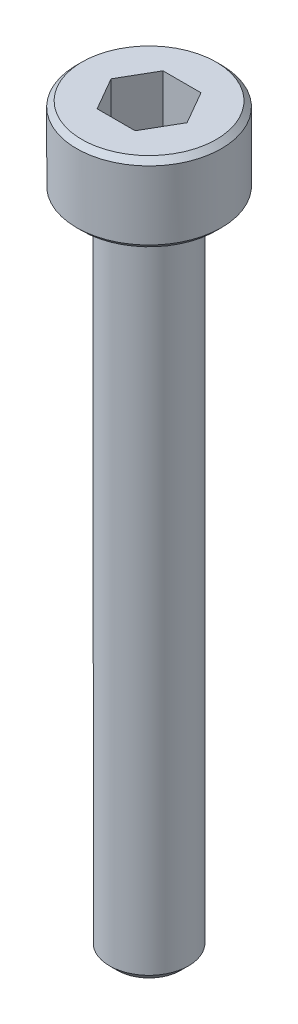
ISO-10303-21;
HEADER;
FILE_DESCRIPTION(('STEP AP214'),'2;1');
FILE_NAME('part.step','',(''),(''),'','','');
FILE_SCHEMA(('AUTOMOTIVE_DESIGN { 1 0 10303 214 1 1 1 1 }'));
ENDSEC;
DATA;
#1=APPLICATION_CONTEXT('core data for automotive mechanical design processes');
#2=APPLICATION_PROTOCOL_DEFINITION('international standard','automotive_design',2000,#1);
#3=PRODUCT_CONTEXT('',#1,'mechanical');
#4=PRODUCT('Part','Part','',(#3));
#5=PRODUCT_RELATED_PRODUCT_CATEGORY('part','',(#4));
#6=PRODUCT_DEFINITION_FORMATION('','',#4);
#7=PRODUCT_DEFINITION_CONTEXT('part definition',#1,'design');
#8=PRODUCT_DEFINITION('design','',#6,#7);
#9=PRODUCT_DEFINITION_SHAPE('','',#8);
#10=(LENGTH_UNIT() NAMED_UNIT(*) SI_UNIT(.MILLI.,.METRE.));
#11=(NAMED_UNIT(*) PLANE_ANGLE_UNIT() SI_UNIT($,.RADIAN.));
#12=(NAMED_UNIT(*) SI_UNIT($,.STERADIAN.) SOLID_ANGLE_UNIT());
#13=UNCERTAINTY_MEASURE_WITH_UNIT(LENGTH_MEASURE(1.E-05),#10,'distance_accuracy_value','');
#14=(GEOMETRIC_REPRESENTATION_CONTEXT(3) GLOBAL_UNCERTAINTY_ASSIGNED_CONTEXT((#13)) GLOBAL_UNIT_ASSIGNED_CONTEXT((#10,
#11,#12)) REPRESENTATION_CONTEXT('',''));
#15=CARTESIAN_POINT('',(0.,0.,0.));
#16=DIRECTION('',(0.,0.,1.));
#17=DIRECTION('',(1.,0.,0.));
#18=AXIS2_PLACEMENT_3D('',#15,#16,#17);
#19=CARTESIAN_POINT('',(0.721687836487033,26.,1.25));
#20=DIRECTION('',(0.866025403784439,0.,0.5));
#21=DIRECTION('',(0.5,0.,-0.866025403784439));
#22=AXIS2_PLACEMENT_3D('',#19,#20,#21);
#23=PLANE('',#22);
#24=DIRECTION('',(0.5,0.,-0.866025403784439));
#25=VECTOR('',#24,1.);
#26=CARTESIAN_POINT('',(0.721687836487033,26.,1.25));
#27=LINE('',#26,#25);
#28=CARTESIAN_POINT('',(0.721687836487033,26.,1.25));
#29=VERTEX_POINT('',#28);
#30=CARTESIAN_POINT('',(1.44337567297406,26.,0.));
#31=VERTEX_POINT('',#30);
#32=EDGE_CURVE('E66',#29,#31,#27,.T.);
#33=ORIENTED_EDGE('',*,*,#32,.F.);
#34=DIRECTION('',(0.,1.,0.));
#35=VECTOR('',#34,1.);
#36=CARTESIAN_POINT('',(0.721687836487033,26.,1.25));
#37=LINE('',#36,#35);
#38=CARTESIAN_POINT('',(0.721687836487033,28.,1.25));
#39=VERTEX_POINT('',#38);
#40=EDGE_CURVE('E85',#29,#39,#37,.T.);
#41=ORIENTED_EDGE('',*,*,#40,.T.);
#42=DIRECTION('',(0.5,0.,-0.866025403784439));
#43=VECTOR('',#42,1.);
#44=CARTESIAN_POINT('',(0.721687836487033,28.,1.25));
#45=LINE('',#44,#43);
#46=CARTESIAN_POINT('',(1.44337567297406,28.,0.));
#47=VERTEX_POINT('',#46);
#48=EDGE_CURVE('E73',#47,#39,#45,.F.);
#49=ORIENTED_EDGE('',*,*,#48,.F.);
#50=DIRECTION('',(0.,1.,0.));
#51=VECTOR('',#50,1.);
#52=CARTESIAN_POINT('',(1.44337567297406,26.,0.));
#53=LINE('',#52,#51);
#54=EDGE_CURVE('E80',#47,#31,#53,.F.);
#55=ORIENTED_EDGE('',*,*,#54,.T.);
#56=EDGE_LOOP('',(#33,#41,#49,#55));
#57=FACE_BOUND('',#56,.T.);
#58=ADVANCED_FACE('F17',(#57),#23,.F.);
#59=CARTESIAN_POINT('',(1.44337567297406,26.,0.));
#60=DIRECTION('',(0.866025403784438,0.,-0.5));
#61=DIRECTION('',(-0.5,0.,-0.866025403784438));
#62=AXIS2_PLACEMENT_3D('',#59,#60,#61);
#63=PLANE('',#62);
#64=DIRECTION('',(-0.5,0.,-0.866025403784438));
#65=VECTOR('',#64,1.);
#66=CARTESIAN_POINT('',(1.44337567297406,26.,0.));
#67=LINE('',#66,#65);
#68=CARTESIAN_POINT('',(0.721687836487031,26.,-1.25));
#69=VERTEX_POINT('',#68);
#70=EDGE_CURVE('E89',#31,#69,#67,.T.);
#71=ORIENTED_EDGE('',*,*,#70,.F.);
#72=ORIENTED_EDGE('',*,*,#54,.F.);
#73=DIRECTION('',(-0.5,0.,-0.866025403784438));
#74=VECTOR('',#73,1.);
#75=CARTESIAN_POINT('',(1.44337567297406,28.,0.));
#76=LINE('',#75,#74);
#77=CARTESIAN_POINT('',(0.721687836487032,28.,-1.25));
#78=VERTEX_POINT('',#77);
#79=EDGE_CURVE('E70',#78,#47,#76,.F.);
#80=ORIENTED_EDGE('',*,*,#79,.F.);
#81=DIRECTION('',(0.,1.,0.));
#82=VECTOR('',#81,1.);
#83=CARTESIAN_POINT('',(0.721687836487031,26.,-1.25));
#84=LINE('',#83,#82);
#85=EDGE_CURVE('E133',#78,#69,#84,.F.);
#86=ORIENTED_EDGE('',*,*,#85,.T.);
#87=EDGE_LOOP('',(#71,#72,#80,#86));
#88=FACE_BOUND('',#87,.T.);
#89=ADVANCED_FACE('F88',(#88),#63,.F.);
#90=CARTESIAN_POINT('',(-0.721687836487032,26.,1.25));
#91=DIRECTION('',(0.,0.,1.));
#92=DIRECTION('',(1.,0.,0.));
#93=AXIS2_PLACEMENT_3D('',#90,#91,#92);
#94=PLANE('',#93);
#95=DIRECTION('',(1.,0.,0.));
#96=VECTOR('',#95,1.);
#97=CARTESIAN_POINT('',(1.44337567297406,26.,1.25));
#98=LINE('',#97,#96);
#99=CARTESIAN_POINT('',(-0.721687836487032,26.,1.25));
#100=VERTEX_POINT('',#99);
#101=EDGE_CURVE('E131',#100,#29,#98,.T.);
#102=ORIENTED_EDGE('',*,*,#101,.F.);
#103=DIRECTION('',(0.,1.,0.));
#104=VECTOR('',#103,1.);
#105=CARTESIAN_POINT('',(-0.721687836487032,26.,1.25));
#106=LINE('',#105,#104);
#107=CARTESIAN_POINT('',(-0.721687836487032,28.,1.25));
#108=VERTEX_POINT('',#107);
#109=EDGE_CURVE('E121',#100,#108,#106,.T.);
#110=ORIENTED_EDGE('',*,*,#109,.T.);
#111=DIRECTION('',(1.,0.,0.));
#112=VECTOR('',#111,1.);
#113=CARTESIAN_POINT('',(-0.721687836487032,28.,1.25));
#114=LINE('',#113,#112);
#115=EDGE_CURVE('E91',#39,#108,#114,.F.);
#116=ORIENTED_EDGE('',*,*,#115,.F.);
#117=ORIENTED_EDGE('',*,*,#40,.F.);
#118=EDGE_LOOP('',(#102,#110,#116,#117));
#119=FACE_BOUND('',#118,.T.);
#120=ADVANCED_FACE('F138',(#119),#94,.F.);
#121=CARTESIAN_POINT('',(0.721687836487031,26.,-1.25));
#122=DIRECTION('',(0.,0.,-1.));
#123=DIRECTION('',(-1.,0.,0.));
#124=AXIS2_PLACEMENT_3D('',#121,#122,#123);
#125=PLANE('',#124);
#126=DIRECTION('',(1.,0.,0.));
#127=VECTOR('',#126,1.);
#128=CARTESIAN_POINT('',(1.44337567297406,26.,-1.25));
#129=LINE('',#128,#127);
#130=CARTESIAN_POINT('',(-0.721687836487032,26.,-1.25));
#131=VERTEX_POINT('',#130);
#132=EDGE_CURVE('E128',#69,#131,#129,.F.);
#133=ORIENTED_EDGE('',*,*,#132,.F.);
#134=ORIENTED_EDGE('',*,*,#85,.F.);
#135=DIRECTION('',(-1.,0.,0.));
#136=VECTOR('',#135,1.);
#137=CARTESIAN_POINT('',(0.721687836487031,28.,-1.25));
#138=LINE('',#137,#136);
#139=CARTESIAN_POINT('',(-0.721687836487032,28.,-1.25));
#140=VERTEX_POINT('',#139);
#141=EDGE_CURVE('E75',#140,#78,#138,.F.);
#142=ORIENTED_EDGE('',*,*,#141,.F.);
#143=DIRECTION('',(0.,1.,0.));
#144=VECTOR('',#143,1.);
#145=CARTESIAN_POINT('',(-0.721687836487032,26.,-1.25));
#146=LINE('',#145,#144);
#147=EDGE_CURVE('E119',#140,#131,#146,.F.);
#148=ORIENTED_EDGE('',*,*,#147,.T.);
#149=EDGE_LOOP('',(#133,#134,#142,#148));
#150=FACE_BOUND('',#149,.T.);
#151=ADVANCED_FACE('F150',(#150),#125,.F.);
#152=CARTESIAN_POINT('',(1.44337567297406,26.,0.));
#153=DIRECTION('',(0.,1.,0.));
#154=DIRECTION('',(0.,0.,1.));
#155=AXIS2_PLACEMENT_3D('',#152,#153,#154);
#156=PLANE('',#155);
#157=ORIENTED_EDGE('',*,*,#132,.T.);
#158=DIRECTION('',(-0.5,0.,0.866025403784439));
#159=VECTOR('',#158,1.);
#160=CARTESIAN_POINT('',(-0.721687836487032,26.,-1.25));
#161=LINE('',#160,#159);
#162=CARTESIAN_POINT('',(-1.44337567297406,26.,0.));
#163=VERTEX_POINT('',#162);
#164=EDGE_CURVE('E117',#131,#163,#161,.T.);
#165=ORIENTED_EDGE('',*,*,#164,.T.);
#166=DIRECTION('',(0.5,0.,0.866025403784438));
#167=VECTOR('',#166,1.);
#168=CARTESIAN_POINT('',(-1.44337567297406,26.,0.));
#169=LINE('',#168,#167);
#170=EDGE_CURVE('E124',#163,#100,#169,.T.);
#171=ORIENTED_EDGE('',*,*,#170,.T.);
#172=ORIENTED_EDGE('',*,*,#101,.T.);
#173=ORIENTED_EDGE('',*,*,#32,.T.);
#174=ORIENTED_EDGE('',*,*,#70,.T.);
#175=EDGE_LOOP('',(#157,#165,#171,#172,#173,#174));
#176=FACE_BOUND('',#175,.T.);
#177=ADVANCED_FACE('F151',(#176),#156,.T.);
#178=CARTESIAN_POINT('',(-1.44337567297406,26.,0.));
#179=DIRECTION('',(-0.866025403784438,0.,0.5));
#180=DIRECTION('',(0.5,0.,0.866025403784438));
#181=AXIS2_PLACEMENT_3D('',#178,#179,#180);
#182=PLANE('',#181);
#183=ORIENTED_EDGE('',*,*,#170,.F.);
#184=DIRECTION('',(0.,1.,0.));
#185=VECTOR('',#184,1.);
#186=CARTESIAN_POINT('',(-1.44337567297407,26.,0.));
#187=LINE('',#186,#185);
#188=CARTESIAN_POINT('',(-1.44337567297406,28.,0.));
#189=VERTEX_POINT('',#188);
#190=EDGE_CURVE('E115',#163,#189,#187,.T.);
#191=ORIENTED_EDGE('',*,*,#190,.T.);
#192=DIRECTION('',(0.5,0.,0.866025403784438));
#193=VECTOR('',#192,1.);
#194=CARTESIAN_POINT('',(-1.44337567297406,28.,0.));
#195=LINE('',#194,#193);
#196=EDGE_CURVE('E35',#108,#189,#195,.F.);
#197=ORIENTED_EDGE('',*,*,#196,.F.);
#198=ORIENTED_EDGE('',*,*,#109,.F.);
#199=EDGE_LOOP('',(#183,#191,#197,#198));
#200=FACE_BOUND('',#199,.T.);
#201=ADVANCED_FACE('F141',(#200),#182,.F.);
#202=CARTESIAN_POINT('',(-0.721687836487032,26.,-1.25));
#203=DIRECTION('',(-0.866025403784439,0.,-0.5));
#204=DIRECTION('',(-0.5,0.,0.866025403784439));
#205=AXIS2_PLACEMENT_3D('',#202,#203,#204);
#206=PLANE('',#205);
#207=ORIENTED_EDGE('',*,*,#164,.F.);
#208=ORIENTED_EDGE('',*,*,#147,.F.);
#209=DIRECTION('',(0.5,0.,-0.866025403784438));
#210=VECTOR('',#209,1.);
#211=CARTESIAN_POINT('',(-1.44337567297406,28.,0.));
#212=LINE('',#211,#210);
#213=EDGE_CURVE('E113',#189,#140,#212,.T.);
#214=ORIENTED_EDGE('',*,*,#213,.F.);
#215=ORIENTED_EDGE('',*,*,#190,.F.);
#216=EDGE_LOOP('',(#207,#208,#214,#215));
#217=FACE_BOUND('',#216,.T.);
#218=ADVANCED_FACE('F147',(#217),#206,.F.);
#219=CARTESIAN_POINT('',(0.,28.,-2.75));
#220=DIRECTION('',(0.,1.,0.));
#221=DIRECTION('',(0.,0.,1.));
#222=AXIS2_PLACEMENT_3D('',#219,#220,#221);
#223=PLANE('',#222);
#224=CARTESIAN_POINT('',(0.,28.00000000002,0.));
#225=DIRECTION('',(0.,-1.,0.));
#226=DIRECTION('',(0.,0.,-1.));
#227=AXIS2_PLACEMENT_3D('',#224,#225,#226);
#228=CIRCLE('',#227,2.55000000004202);
#229=CARTESIAN_POINT('',(0.,28.00000000002,-2.55000000004202));
#230=VERTEX_POINT('',#229);
#231=EDGE_CURVE('E20',#230,#230,#228,.T.);
#232=ORIENTED_EDGE('',*,*,#231,.F.);
#233=EDGE_LOOP('',(#232));
#234=FACE_BOUND('',#233,.T.);
#235=ORIENTED_EDGE('',*,*,#196,.T.);
#236=ORIENTED_EDGE('',*,*,#213,.T.);
#237=ORIENTED_EDGE('',*,*,#141,.T.);
#238=ORIENTED_EDGE('',*,*,#79,.T.);
#239=ORIENTED_EDGE('',*,*,#48,.T.);
#240=ORIENTED_EDGE('',*,*,#115,.T.);
#241=EDGE_LOOP('',(#235,#236,#237,#238,#239,#240));
#242=FACE_BOUND('',#241,.T.);
#243=ADVANCED_FACE('F72',(#234,#242),#223,.T.);
#244=CARTESIAN_POINT('',(0.,27.8000000000702,0.));
#245=DIRECTION('',(0.,-1.,0.));
#246=DIRECTION('',(0.,0.,-1.));
#247=AXIS2_PLACEMENT_3D('',#244,#245,#246);
#248=CONICAL_SURFACE('',#247,2.74999999999181,0.785398163397448);
#249=ORIENTED_EDGE('',*,*,#231,.T.);
#250=EDGE_LOOP('',(#249));
#251=FACE_BOUND('',#250,.T.);
#252=CARTESIAN_POINT('',(0.,27.8,0.));
#253=DIRECTION('',(0.,-1.,0.));
#254=DIRECTION('',(0.,0.,-1.));
#255=AXIS2_PLACEMENT_3D('',#252,#253,#254);
#256=CIRCLE('',#255,2.75);
#257=CARTESIAN_POINT('',(0.,27.8,-2.75));
#258=VERTEX_POINT('',#257);
#259=EDGE_CURVE('E106',#258,#258,#256,.T.);
#260=ORIENTED_EDGE('',*,*,#259,.F.);
#261=EDGE_LOOP('',(#260));
#262=FACE_BOUND('',#261,.T.);
#263=ADVANCED_FACE('F186',(#251,#262),#248,.T.);
#264=CARTESIAN_POINT('',(0.,0.,0.));
#265=DIRECTION('',(0.,-1.,0.));
#266=DIRECTION('',(0.,0.,-1.));
#267=AXIS2_PLACEMENT_3D('',#264,#265,#266);
#268=CYLINDRICAL_SURFACE('',#267,2.75);
#269=ORIENTED_EDGE('',*,*,#259,.T.);
#270=EDGE_LOOP('',(#269));
#271=FACE_BOUND('',#270,.T.);
#272=CARTESIAN_POINT('',(0.,25.2000000000407,0.));
#273=DIRECTION('',(0.,1.,0.));
#274=DIRECTION('',(-1.,0.,0.));
#275=AXIS2_PLACEMENT_3D('',#272,#273,#274);
#276=CIRCLE('',#275,2.75000000004866);
#277=CARTESIAN_POINT('',(-2.75000000004866,25.2000000000407,0.));
#278=VERTEX_POINT('',#277);
#279=EDGE_CURVE('E102',#278,#278,#276,.F.);
#280=ORIENTED_EDGE('',*,*,#279,.F.);
#281=EDGE_LOOP('',(#280));
#282=FACE_BOUND('',#281,.T.);
#283=ADVANCED_FACE('F183',(#271,#282),#268,.T.);
#284=CARTESIAN_POINT('',(0.,25.2000000000407,0.));
#285=DIRECTION('',(0.,1.,0.));
#286=DIRECTION('',(0.,0.,1.));
#287=AXIS2_PLACEMENT_3D('',#284,#285,#286);
#288=CONICAL_SURFACE('',#287,2.75000000004866,0.785398163113231);
#289=ORIENTED_EDGE('',*,*,#279,.T.);
#290=EDGE_LOOP('',(#289));
#291=FACE_BOUND('',#290,.T.);
#292=CARTESIAN_POINT('',(0.,25.0000000000341,0.));
#293=DIRECTION('',(0.,1.,0.));
#294=DIRECTION('',(0.,0.,1.));
#295=AXIS2_PLACEMENT_3D('',#292,#293,#294);
#296=CIRCLE('',#295,2.55000000015571);
#297=CARTESIAN_POINT('',(0.,25.0000000000341,2.55000000015571));
#298=VERTEX_POINT('',#297);
#299=EDGE_CURVE('E100',#298,#298,#296,.F.);
#300=ORIENTED_EDGE('',*,*,#299,.F.);
#301=EDGE_LOOP('',(#300));
#302=FACE_BOUND('',#301,.T.);
#303=ADVANCED_FACE('F179',(#291,#302),#288,.T.);
#304=CARTESIAN_POINT('',(0.,0.,0.));
#305=DIRECTION('',(0.,-1.,0.));
#306=DIRECTION('',(0.,0.,-1.));
#307=AXIS2_PLACEMENT_3D('',#304,#305,#306);
#308=PLANE('',#307);
#309=CARTESIAN_POINT('',(0.,-5.6843418860808E-11,0.));
#310=DIRECTION('',(0.,1.,0.));
#311=DIRECTION('',(0.,0.,1.));
#312=AXIS2_PLACEMENT_3D('',#309,#310,#311);
#313=CIRCLE('',#312,1.19999999998299);
#314=CARTESIAN_POINT('',(0.,-5.6843418860808E-11,1.19999999998299));
#315=VERTEX_POINT('',#314);
#316=EDGE_CURVE('E98',#315,#315,#313,.T.);
#317=ORIENTED_EDGE('',*,*,#316,.F.);
#318=EDGE_LOOP('',(#317));
#319=FACE_BOUND('',#318,.T.);
#320=ADVANCED_FACE('F176',(#319),#308,.T.);
#321=CARTESIAN_POINT('',(0.,25.,-1.5));
#322=DIRECTION('',(0.,-1.,0.));
#323=DIRECTION('',(0.,0.,-1.));
#324=AXIS2_PLACEMENT_3D('',#321,#322,#323);
#325=PLANE('',#324);
#326=ORIENTED_EDGE('',*,*,#299,.T.);
#327=EDGE_LOOP('',(#326));
#328=FACE_BOUND('',#327,.T.);
#329=CARTESIAN_POINT('',(0.,25.,0.));
#330=DIRECTION('',(0.,-1.,0.));
#331=DIRECTION('',(0.,0.,-1.));
#332=AXIS2_PLACEMENT_3D('',#329,#330,#331);
#333=CIRCLE('',#332,1.5);
#334=CARTESIAN_POINT('',(0.,25.,-1.5));
#335=VERTEX_POINT('',#334);
#336=EDGE_CURVE('E26',#335,#335,#333,.T.);
#337=ORIENTED_EDGE('',*,*,#336,.F.);
#338=EDGE_LOOP('',(#337));
#339=FACE_BOUND('',#338,.T.);
#340=ADVANCED_FACE('F169',(#328,#339),#325,.T.);
#341=CARTESIAN_POINT('',(0.,0.300000000038381,0.));
#342=DIRECTION('',(0.,1.,0.));
#343=DIRECTION('',(0.,0.,1.));
#344=AXIS2_PLACEMENT_3D('',#341,#342,#343);
#345=CONICAL_SURFACE('',#344,1.50000000002137,0.785398163302709);
#346=CARTESIAN_POINT('',(0.,0.300000000000006,0.));
#347=DIRECTION('',(0.,-1.,0.));
#348=DIRECTION('',(0.,0.,-1.));
#349=AXIS2_PLACEMENT_3D('',#346,#347,#348);
#350=CIRCLE('',#349,1.5);
#351=CARTESIAN_POINT('',(0.,0.300000000000006,-1.5));
#352=VERTEX_POINT('',#351);
#353=EDGE_CURVE('E11',#352,#352,#350,.F.);
#354=ORIENTED_EDGE('',*,*,#353,.F.);
#355=EDGE_LOOP('',(#354));
#356=FACE_BOUND('',#355,.T.);
#357=ORIENTED_EDGE('',*,*,#316,.T.);
#358=EDGE_LOOP('',(#357));
#359=FACE_BOUND('',#358,.T.);
#360=ADVANCED_FACE('F163',(#356,#359),#345,.T.);
#361=CARTESIAN_POINT('',(0.,0.,0.));
#362=DIRECTION('',(0.,-1.,0.));
#363=DIRECTION('',(0.,0.,-1.));
#364=AXIS2_PLACEMENT_3D('',#361,#362,#363);
#365=CYLINDRICAL_SURFACE('',#364,1.5);
#366=ORIENTED_EDGE('',*,*,#353,.T.);
#367=EDGE_LOOP('',(#366));
#368=FACE_BOUND('',#367,.T.);
#369=ORIENTED_EDGE('',*,*,#336,.T.);
#370=EDGE_LOOP('',(#369));
#371=FACE_BOUND('',#370,.T.);
#372=ADVANCED_FACE('F161',(#368,#371),#365,.T.);
#373=CLOSED_SHELL('',(#58,#89,#120,#151,#177,#201,#218,#243,#263,#283,#303,#320,#340,#360,#372));
#374=MANIFOLD_SOLID_BREP('B1',#373);
#375=ADVANCED_BREP_SHAPE_REPRESENTATION('',(#18,#374),#14);
#376=SHAPE_DEFINITION_REPRESENTATION(#9,#375);
ENDSEC;
END-ISO-10303-21;
